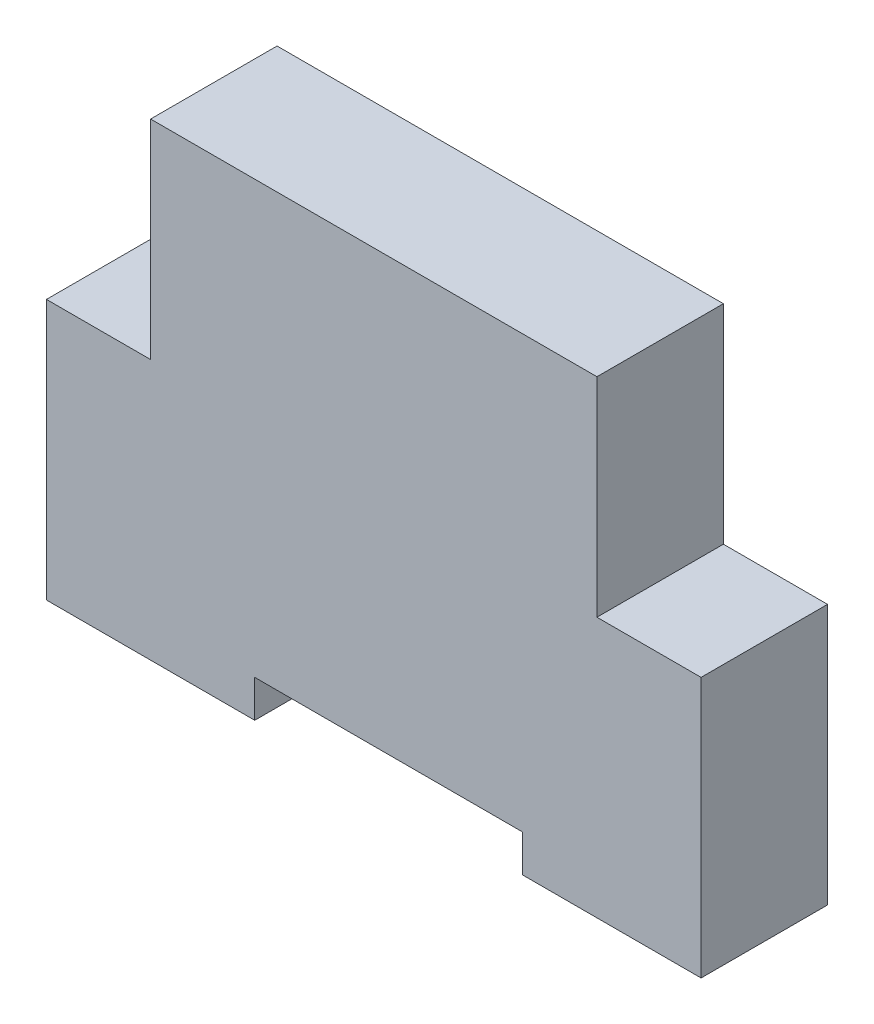
ISO-10303-21;
HEADER;
FILE_DESCRIPTION(('STEP AP214'),'2;1');
FILE_NAME('part.step','',(''),(''),'','','');
FILE_SCHEMA(('AUTOMOTIVE_DESIGN { 1 0 10303 214 1 1 1 1 }'));
ENDSEC;
DATA;
#1=APPLICATION_CONTEXT('core data for automotive mechanical design processes');
#2=APPLICATION_PROTOCOL_DEFINITION('international standard','automotive_design',2000,#1);
#3=PRODUCT_CONTEXT('',#1,'mechanical');
#4=PRODUCT('Part','Part','',(#3));
#5=PRODUCT_RELATED_PRODUCT_CATEGORY('part','',(#4));
#6=PRODUCT_DEFINITION_FORMATION('','',#4);
#7=PRODUCT_DEFINITION_CONTEXT('part definition',#1,'design');
#8=PRODUCT_DEFINITION('design','',#6,#7);
#9=PRODUCT_DEFINITION_SHAPE('','',#8);
#10=(LENGTH_UNIT() NAMED_UNIT(*) SI_UNIT(.MILLI.,.METRE.));
#11=(NAMED_UNIT(*) PLANE_ANGLE_UNIT() SI_UNIT($,.RADIAN.));
#12=(NAMED_UNIT(*) SI_UNIT($,.STERADIAN.) SOLID_ANGLE_UNIT());
#13=UNCERTAINTY_MEASURE_WITH_UNIT(LENGTH_MEASURE(1.E-05),#10,'distance_accuracy_value','');
#14=(GEOMETRIC_REPRESENTATION_CONTEXT(3) GLOBAL_UNCERTAINTY_ASSIGNED_CONTEXT((#13)) GLOBAL_UNIT_ASSIGNED_CONTEXT((#10,
#11,#12)) REPRESENTATION_CONTEXT('',''));
#15=CARTESIAN_POINT('',(0.,0.,0.));
#16=DIRECTION('',(0.,0.,1.));
#17=DIRECTION('',(1.,0.,0.));
#18=AXIS2_PLACEMENT_3D('',#15,#16,#17);
#19=CARTESIAN_POINT('',(-32.,30.,17.));
#20=DIRECTION('',(1.,0.,0.));
#21=DIRECTION('',(0.,0.,-1.));
#22=AXIS2_PLACEMENT_3D('',#19,#20,#21);
#23=PLANE('',#22);
#24=DIRECTION('',(0.,-1.,0.));
#25=VECTOR('',#24,1.);
#26=CARTESIAN_POINT('',(-32.,30.,0.));
#27=LINE('',#26,#25);
#28=CARTESIAN_POINT('',(-32.,58.,0.));
#29=VERTEX_POINT('',#28);
#30=CARTESIAN_POINT('',(-32.,30.,0.));
#31=VERTEX_POINT('',#30);
#32=EDGE_CURVE('E164',#29,#31,#27,.T.);
#33=ORIENTED_EDGE('',*,*,#32,.T.);
#34=DIRECTION('',(0.,0.,-1.));
#35=VECTOR('',#34,1.);
#36=CARTESIAN_POINT('',(-32.,30.,17.));
#37=LINE('',#36,#35);
#38=CARTESIAN_POINT('',(-32.,30.,17.));
#39=VERTEX_POINT('',#38);
#40=EDGE_CURVE('E11',#39,#31,#37,.T.);
#41=ORIENTED_EDGE('',*,*,#40,.F.);
#42=DIRECTION('',(0.,-1.,0.));
#43=VECTOR('',#42,1.);
#44=CARTESIAN_POINT('',(-32.,30.,17.));
#45=LINE('',#44,#43);
#46=CARTESIAN_POINT('',(-32.,58.,17.));
#47=VERTEX_POINT('',#46);
#48=EDGE_CURVE('E198',#47,#39,#45,.T.);
#49=ORIENTED_EDGE('',*,*,#48,.F.);
#50=DIRECTION('',(0.,0.,-1.));
#51=VECTOR('',#50,1.);
#52=CARTESIAN_POINT('',(-32.,58.,17.));
#53=LINE('',#52,#51);
#54=EDGE_CURVE('E160',#47,#29,#53,.T.);
#55=ORIENTED_EDGE('',*,*,#54,.T.);
#56=EDGE_LOOP('',(#33,#41,#49,#55));
#57=FACE_BOUND('',#56,.T.);
#58=ADVANCED_FACE('F39',(#57),#23,.F.);
#59=CARTESIAN_POINT('',(-46.,30.,17.));
#60=DIRECTION('',(0.,-1.,0.));
#61=DIRECTION('',(0.,0.,-1.));
#62=AXIS2_PLACEMENT_3D('',#59,#60,#61);
#63=PLANE('',#62);
#64=DIRECTION('',(-1.,0.,0.));
#65=VECTOR('',#64,1.);
#66=CARTESIAN_POINT('',(-46.,30.,0.));
#67=LINE('',#66,#65);
#68=CARTESIAN_POINT('',(-46.,30.,0.));
#69=VERTEX_POINT('',#68);
#70=EDGE_CURVE('E168',#31,#69,#67,.T.);
#71=ORIENTED_EDGE('',*,*,#70,.T.);
#72=DIRECTION('',(0.,0.,-1.));
#73=VECTOR('',#72,1.);
#74=CARTESIAN_POINT('',(-46.,30.,17.));
#75=LINE('',#74,#73);
#76=CARTESIAN_POINT('',(-46.,30.,17.));
#77=VERTEX_POINT('',#76);
#78=EDGE_CURVE('E48',#77,#69,#75,.T.);
#79=ORIENTED_EDGE('',*,*,#78,.F.);
#80=DIRECTION('',(-1.,0.,0.));
#81=VECTOR('',#80,1.);
#82=CARTESIAN_POINT('',(-46.,30.,17.));
#83=LINE('',#82,#81);
#84=EDGE_CURVE('E111',#39,#77,#83,.T.);
#85=ORIENTED_EDGE('',*,*,#84,.F.);
#86=ORIENTED_EDGE('',*,*,#40,.T.);
#87=EDGE_LOOP('',(#71,#79,#85,#86));
#88=FACE_BOUND('',#87,.T.);
#89=ADVANCED_FACE('F292',(#88),#63,.F.);
#90=CARTESIAN_POINT('',(-46.,-5.00000000000001,17.));
#91=DIRECTION('',(1.,0.,0.));
#92=DIRECTION('',(0.,1.,0.));
#93=AXIS2_PLACEMENT_3D('',#90,#91,#92);
#94=PLANE('',#93);
#95=DIRECTION('',(0.,-1.,0.));
#96=VECTOR('',#95,1.);
#97=CARTESIAN_POINT('',(-46.,-5.00000000000001,0.));
#98=LINE('',#97,#96);
#99=CARTESIAN_POINT('',(-46.,-5.00000000000001,0.));
#100=VERTEX_POINT('',#99);
#101=EDGE_CURVE('E171',#69,#100,#98,.T.);
#102=ORIENTED_EDGE('',*,*,#101,.T.);
#103=DIRECTION('',(0.,0.,-1.));
#104=VECTOR('',#103,1.);
#105=CARTESIAN_POINT('',(-46.,-5.00000000000001,17.));
#106=LINE('',#105,#104);
#107=CARTESIAN_POINT('',(-46.,-5.00000000000001,17.));
#108=VERTEX_POINT('',#107);
#109=EDGE_CURVE('E225',#108,#100,#106,.T.);
#110=ORIENTED_EDGE('',*,*,#109,.F.);
#111=DIRECTION('',(0.,-1.,0.));
#112=VECTOR('',#111,1.);
#113=CARTESIAN_POINT('',(-46.,-5.00000000000001,17.));
#114=LINE('',#113,#112);
#115=EDGE_CURVE('E235',#77,#108,#114,.T.);
#116=ORIENTED_EDGE('',*,*,#115,.F.);
#117=ORIENTED_EDGE('',*,*,#78,.T.);
#118=EDGE_LOOP('',(#102,#110,#116,#117));
#119=FACE_BOUND('',#118,.T.);
#120=ADVANCED_FACE('F233',(#119),#94,.F.);
#121=CARTESIAN_POINT('',(-18.,-5.,17.));
#122=DIRECTION('',(0.,1.,0.));
#123=DIRECTION('',(-1.,0.,0.));
#124=AXIS2_PLACEMENT_3D('',#121,#122,#123);
#125=PLANE('',#124);
#126=DIRECTION('',(1.,0.,0.));
#127=VECTOR('',#126,1.);
#128=CARTESIAN_POINT('',(-18.,-5.,0.));
#129=LINE('',#128,#127);
#130=CARTESIAN_POINT('',(-18.,-5.,0.));
#131=VERTEX_POINT('',#130);
#132=EDGE_CURVE('E174',#100,#131,#129,.T.);
#133=ORIENTED_EDGE('',*,*,#132,.T.);
#134=DIRECTION('',(0.,0.,-1.));
#135=VECTOR('',#134,1.);
#136=CARTESIAN_POINT('',(-18.,-5.,17.));
#137=LINE('',#136,#135);
#138=CARTESIAN_POINT('',(-18.,-5.,17.));
#139=VERTEX_POINT('',#138);
#140=EDGE_CURVE('E221',#139,#131,#137,.T.);
#141=ORIENTED_EDGE('',*,*,#140,.F.);
#142=DIRECTION('',(1.,0.,0.));
#143=VECTOR('',#142,1.);
#144=CARTESIAN_POINT('',(-18.,-5.,17.));
#145=LINE('',#144,#143);
#146=EDGE_CURVE('E254',#108,#139,#145,.T.);
#147=ORIENTED_EDGE('',*,*,#146,.F.);
#148=ORIENTED_EDGE('',*,*,#109,.T.);
#149=EDGE_LOOP('',(#133,#141,#147,#148));
#150=FACE_BOUND('',#149,.T.);
#151=ADVANCED_FACE('F244',(#150),#125,.F.);
#152=CARTESIAN_POINT('',(-18.,0.,17.));
#153=DIRECTION('',(-1.,0.,0.));
#154=DIRECTION('',(0.,-1.,0.));
#155=AXIS2_PLACEMENT_3D('',#152,#153,#154);
#156=PLANE('',#155);
#157=DIRECTION('',(0.,1.,0.));
#158=VECTOR('',#157,1.);
#159=CARTESIAN_POINT('',(-18.,0.,0.));
#160=LINE('',#159,#158);
#161=CARTESIAN_POINT('',(-18.,0.,0.));
#162=VERTEX_POINT('',#161);
#163=EDGE_CURVE('E177',#131,#162,#160,.T.);
#164=ORIENTED_EDGE('',*,*,#163,.T.);
#165=DIRECTION('',(0.,0.,-1.));
#166=VECTOR('',#165,1.);
#167=CARTESIAN_POINT('',(-18.,0.,17.));
#168=LINE('',#167,#166);
#169=CARTESIAN_POINT('',(-18.,0.,17.));
#170=VERTEX_POINT('',#169);
#171=EDGE_CURVE('E217',#170,#162,#168,.T.);
#172=ORIENTED_EDGE('',*,*,#171,.F.);
#173=DIRECTION('',(0.,1.,0.));
#174=VECTOR('',#173,1.);
#175=CARTESIAN_POINT('',(-18.,0.,17.));
#176=LINE('',#175,#174);
#177=EDGE_CURVE('E250',#139,#170,#176,.T.);
#178=ORIENTED_EDGE('',*,*,#177,.F.);
#179=ORIENTED_EDGE('',*,*,#140,.T.);
#180=EDGE_LOOP('',(#164,#172,#178,#179));
#181=FACE_BOUND('',#180,.T.);
#182=ADVANCED_FACE('F248',(#181),#156,.F.);
#183=CARTESIAN_POINT('',(18.,0.,17.));
#184=DIRECTION('',(0.,1.,0.));
#185=DIRECTION('',(-1.,0.,0.));
#186=AXIS2_PLACEMENT_3D('',#183,#184,#185);
#187=PLANE('',#186);
#188=DIRECTION('',(1.,0.,0.));
#189=VECTOR('',#188,1.);
#190=CARTESIAN_POINT('',(18.,0.,0.));
#191=LINE('',#190,#189);
#192=CARTESIAN_POINT('',(18.,0.,0.));
#193=VERTEX_POINT('',#192);
#194=EDGE_CURVE('E180',#162,#193,#191,.T.);
#195=ORIENTED_EDGE('',*,*,#194,.T.);
#196=DIRECTION('',(0.,0.,-1.));
#197=VECTOR('',#196,1.);
#198=CARTESIAN_POINT('',(18.,0.,17.));
#199=LINE('',#198,#197);
#200=CARTESIAN_POINT('',(18.,0.,17.));
#201=VERTEX_POINT('',#200);
#202=EDGE_CURVE('E213',#201,#193,#199,.T.);
#203=ORIENTED_EDGE('',*,*,#202,.F.);
#204=DIRECTION('',(1.,0.,0.));
#205=VECTOR('',#204,1.);
#206=CARTESIAN_POINT('',(18.,0.,17.));
#207=LINE('',#206,#205);
#208=EDGE_CURVE('E253',#170,#201,#207,.T.);
#209=ORIENTED_EDGE('',*,*,#208,.F.);
#210=ORIENTED_EDGE('',*,*,#171,.T.);
#211=EDGE_LOOP('',(#195,#203,#209,#210));
#212=FACE_BOUND('',#211,.T.);
#213=ADVANCED_FACE('F305',(#212),#187,.F.);
#214=CARTESIAN_POINT('',(18.,-4.99999999999999,17.));
#215=DIRECTION('',(1.,0.,0.));
#216=DIRECTION('',(0.,1.,0.));
#217=AXIS2_PLACEMENT_3D('',#214,#215,#216);
#218=PLANE('',#217);
#219=DIRECTION('',(0.,-1.,0.));
#220=VECTOR('',#219,1.);
#221=CARTESIAN_POINT('',(18.,-4.99999999999999,0.));
#222=LINE('',#221,#220);
#223=CARTESIAN_POINT('',(18.,-4.99999999999999,0.));
#224=VERTEX_POINT('',#223);
#225=EDGE_CURVE('E183',#193,#224,#222,.T.);
#226=ORIENTED_EDGE('',*,*,#225,.T.);
#227=DIRECTION('',(0.,0.,-1.));
#228=VECTOR('',#227,1.);
#229=CARTESIAN_POINT('',(18.,-4.99999999999999,17.));
#230=LINE('',#229,#228);
#231=CARTESIAN_POINT('',(18.,-4.99999999999999,17.));
#232=VERTEX_POINT('',#231);
#233=EDGE_CURVE('E209',#232,#224,#230,.T.);
#234=ORIENTED_EDGE('',*,*,#233,.F.);
#235=DIRECTION('',(0.,-1.,0.));
#236=VECTOR('',#235,1.);
#237=CARTESIAN_POINT('',(18.,-4.99999999999999,17.));
#238=LINE('',#237,#236);
#239=EDGE_CURVE('E258',#201,#232,#238,.T.);
#240=ORIENTED_EDGE('',*,*,#239,.F.);
#241=ORIENTED_EDGE('',*,*,#202,.T.);
#242=EDGE_LOOP('',(#226,#234,#240,#241));
#243=FACE_BOUND('',#242,.T.);
#244=ADVANCED_FACE('F308',(#243),#218,.F.);
#245=CARTESIAN_POINT('',(42.,-5.,17.));
#246=DIRECTION('',(0.,1.,0.));
#247=DIRECTION('',(-1.,0.,0.));
#248=AXIS2_PLACEMENT_3D('',#245,#246,#247);
#249=PLANE('',#248);
#250=DIRECTION('',(1.,0.,0.));
#251=VECTOR('',#250,1.);
#252=CARTESIAN_POINT('',(42.,-5.,0.));
#253=LINE('',#252,#251);
#254=CARTESIAN_POINT('',(42.,-5.,0.));
#255=VERTEX_POINT('',#254);
#256=EDGE_CURVE('E186',#224,#255,#253,.T.);
#257=ORIENTED_EDGE('',*,*,#256,.T.);
#258=DIRECTION('',(0.,0.,-1.));
#259=VECTOR('',#258,1.);
#260=CARTESIAN_POINT('',(42.,-5.,17.));
#261=LINE('',#260,#259);
#262=CARTESIAN_POINT('',(42.,-5.,17.));
#263=VERTEX_POINT('',#262);
#264=EDGE_CURVE('E205',#263,#255,#261,.T.);
#265=ORIENTED_EDGE('',*,*,#264,.F.);
#266=DIRECTION('',(1.,0.,0.));
#267=VECTOR('',#266,1.);
#268=CARTESIAN_POINT('',(42.,-5.,17.));
#269=LINE('',#268,#267);
#270=EDGE_CURVE('E265',#232,#263,#269,.T.);
#271=ORIENTED_EDGE('',*,*,#270,.F.);
#272=ORIENTED_EDGE('',*,*,#233,.T.);
#273=EDGE_LOOP('',(#257,#265,#271,#272));
#274=FACE_BOUND('',#273,.T.);
#275=ADVANCED_FACE('F273',(#274),#249,.F.);
#276=CARTESIAN_POINT('',(42.,30.,17.));
#277=DIRECTION('',(-1.,0.,0.));
#278=DIRECTION('',(0.,-1.,0.));
#279=AXIS2_PLACEMENT_3D('',#276,#277,#278);
#280=PLANE('',#279);
#281=DIRECTION('',(0.,1.,0.));
#282=VECTOR('',#281,1.);
#283=CARTESIAN_POINT('',(42.,30.,0.));
#284=LINE('',#283,#282);
#285=CARTESIAN_POINT('',(42.,30.,0.));
#286=VERTEX_POINT('',#285);
#287=EDGE_CURVE('E189',#255,#286,#284,.T.);
#288=ORIENTED_EDGE('',*,*,#287,.T.);
#289=DIRECTION('',(0.,0.,-1.));
#290=VECTOR('',#289,1.);
#291=CARTESIAN_POINT('',(42.,30.,17.));
#292=LINE('',#291,#290);
#293=CARTESIAN_POINT('',(42.,30.,17.));
#294=VERTEX_POINT('',#293);
#295=EDGE_CURVE('E153',#294,#286,#292,.T.);
#296=ORIENTED_EDGE('',*,*,#295,.F.);
#297=DIRECTION('',(0.,1.,0.));
#298=VECTOR('',#297,1.);
#299=CARTESIAN_POINT('',(42.,30.,17.));
#300=LINE('',#299,#298);
#301=EDGE_CURVE('E142',#263,#294,#300,.T.);
#302=ORIENTED_EDGE('',*,*,#301,.F.);
#303=ORIENTED_EDGE('',*,*,#264,.T.);
#304=EDGE_LOOP('',(#288,#296,#302,#303));
#305=FACE_BOUND('',#304,.T.);
#306=ADVANCED_FACE('F277',(#305),#280,.F.);
#307=CARTESIAN_POINT('',(28.,30.,17.));
#308=DIRECTION('',(0.,-1.,0.));
#309=DIRECTION('',(0.,0.,-1.));
#310=AXIS2_PLACEMENT_3D('',#307,#308,#309);
#311=PLANE('',#310);
#312=DIRECTION('',(-1.,0.,0.));
#313=VECTOR('',#312,1.);
#314=CARTESIAN_POINT('',(28.,30.,0.));
#315=LINE('',#314,#313);
#316=CARTESIAN_POINT('',(28.,30.,0.));
#317=VERTEX_POINT('',#316);
#318=EDGE_CURVE('E151',#286,#317,#315,.T.);
#319=ORIENTED_EDGE('',*,*,#318,.T.);
#320=DIRECTION('',(0.,0.,-1.));
#321=VECTOR('',#320,1.);
#322=CARTESIAN_POINT('',(28.,30.,17.));
#323=LINE('',#322,#321);
#324=CARTESIAN_POINT('',(28.,30.,17.));
#325=VERTEX_POINT('',#324);
#326=EDGE_CURVE('E148',#325,#317,#323,.T.);
#327=ORIENTED_EDGE('',*,*,#326,.F.);
#328=DIRECTION('',(-1.,0.,0.));
#329=VECTOR('',#328,1.);
#330=CARTESIAN_POINT('',(28.,30.,17.));
#331=LINE('',#330,#329);
#332=EDGE_CURVE('E136',#294,#325,#331,.T.);
#333=ORIENTED_EDGE('',*,*,#332,.F.);
#334=ORIENTED_EDGE('',*,*,#295,.T.);
#335=EDGE_LOOP('',(#319,#327,#333,#334));
#336=FACE_BOUND('',#335,.T.);
#337=ADVANCED_FACE('F149',(#336),#311,.F.);
#338=CARTESIAN_POINT('',(28.,58.,17.));
#339=DIRECTION('',(-1.,0.,0.));
#340=DIRECTION('',(0.,-1.,0.));
#341=AXIS2_PLACEMENT_3D('',#338,#339,#340);
#342=PLANE('',#341);
#343=DIRECTION('',(0.,1.,0.));
#344=VECTOR('',#343,1.);
#345=CARTESIAN_POINT('',(28.,58.,0.));
#346=LINE('',#345,#344);
#347=CARTESIAN_POINT('',(28.,58.,0.));
#348=VERTEX_POINT('',#347);
#349=EDGE_CURVE('E97',#317,#348,#346,.T.);
#350=ORIENTED_EDGE('',*,*,#349,.T.);
#351=DIRECTION('',(0.,0.,-1.));
#352=VECTOR('',#351,1.);
#353=CARTESIAN_POINT('',(28.,58.,17.));
#354=LINE('',#353,#352);
#355=CARTESIAN_POINT('',(28.,58.,17.));
#356=VERTEX_POINT('',#355);
#357=EDGE_CURVE('E154',#356,#348,#354,.T.);
#358=ORIENTED_EDGE('',*,*,#357,.F.);
#359=DIRECTION('',(0.,1.,0.));
#360=VECTOR('',#359,1.);
#361=CARTESIAN_POINT('',(28.,58.,17.));
#362=LINE('',#361,#360);
#363=EDGE_CURVE('E140',#325,#356,#362,.T.);
#364=ORIENTED_EDGE('',*,*,#363,.F.);
#365=ORIENTED_EDGE('',*,*,#326,.T.);
#366=EDGE_LOOP('',(#350,#358,#364,#365));
#367=FACE_BOUND('',#366,.T.);
#368=ADVANCED_FACE('F156',(#367),#342,.F.);
#369=CARTESIAN_POINT('',(-32.,58.,17.));
#370=DIRECTION('',(0.,-1.,0.));
#371=DIRECTION('',(0.,0.,-1.));
#372=AXIS2_PLACEMENT_3D('',#369,#370,#371);
#373=PLANE('',#372);
#374=DIRECTION('',(-1.,0.,0.));
#375=VECTOR('',#374,1.);
#376=CARTESIAN_POINT('',(-32.,58.,0.));
#377=LINE('',#376,#375);
#378=EDGE_CURVE('E103',#348,#29,#377,.T.);
#379=ORIENTED_EDGE('',*,*,#378,.T.);
#380=ORIENTED_EDGE('',*,*,#54,.F.);
#381=DIRECTION('',(-1.,0.,0.));
#382=VECTOR('',#381,1.);
#383=CARTESIAN_POINT('',(-32.,58.,17.));
#384=LINE('',#383,#382);
#385=EDGE_CURVE('E56',#356,#47,#384,.T.);
#386=ORIENTED_EDGE('',*,*,#385,.F.);
#387=ORIENTED_EDGE('',*,*,#357,.T.);
#388=EDGE_LOOP('',(#379,#380,#386,#387));
#389=FACE_BOUND('',#388,.T.);
#390=ADVANCED_FACE('F281',(#389),#373,.F.);
#391=CARTESIAN_POINT('',(0.,0.,17.));
#392=DIRECTION('',(0.,0.,-1.));
#393=DIRECTION('',(-1.,0.,0.));
#394=AXIS2_PLACEMENT_3D('',#391,#392,#393);
#395=PLANE('',#394);
#396=ORIENTED_EDGE('',*,*,#48,.T.);
#397=ORIENTED_EDGE('',*,*,#84,.T.);
#398=ORIENTED_EDGE('',*,*,#115,.T.);
#399=ORIENTED_EDGE('',*,*,#146,.T.);
#400=ORIENTED_EDGE('',*,*,#177,.T.);
#401=ORIENTED_EDGE('',*,*,#208,.T.);
#402=ORIENTED_EDGE('',*,*,#239,.T.);
#403=ORIENTED_EDGE('',*,*,#270,.T.);
#404=ORIENTED_EDGE('',*,*,#301,.T.);
#405=ORIENTED_EDGE('',*,*,#332,.T.);
#406=ORIENTED_EDGE('',*,*,#363,.T.);
#407=ORIENTED_EDGE('',*,*,#385,.T.);
#408=EDGE_LOOP('',(#396,#397,#398,#399,#400,#401,#402,#403,#404,#405,#406,#407));
#409=FACE_BOUND('',#408,.T.);
#410=ADVANCED_FACE('F138',(#409),#395,.F.);
#411=CARTESIAN_POINT('',(0.,0.,0.));
#412=DIRECTION('',(0.,0.,-1.));
#413=DIRECTION('',(-1.,0.,0.));
#414=AXIS2_PLACEMENT_3D('',#411,#412,#413);
#415=PLANE('',#414);
#416=ORIENTED_EDGE('',*,*,#32,.F.);
#417=ORIENTED_EDGE('',*,*,#378,.F.);
#418=ORIENTED_EDGE('',*,*,#349,.F.);
#419=ORIENTED_EDGE('',*,*,#318,.F.);
#420=ORIENTED_EDGE('',*,*,#287,.F.);
#421=ORIENTED_EDGE('',*,*,#256,.F.);
#422=ORIENTED_EDGE('',*,*,#225,.F.);
#423=ORIENTED_EDGE('',*,*,#194,.F.);
#424=ORIENTED_EDGE('',*,*,#163,.F.);
#425=ORIENTED_EDGE('',*,*,#132,.F.);
#426=ORIENTED_EDGE('',*,*,#101,.F.);
#427=ORIENTED_EDGE('',*,*,#70,.F.);
#428=EDGE_LOOP('',(#416,#417,#418,#419,#420,#421,#422,#423,#424,#425,#426,#427));
#429=FACE_BOUND('',#428,.T.);
#430=ADVANCED_FACE('F239',(#429),#415,.T.);
#431=CLOSED_SHELL('',(#58,#89,#120,#151,#182,#213,#244,#275,#306,#337,#368,#390,#410,#430));
#432=MANIFOLD_SOLID_BREP('B2',#431);
#433=ADVANCED_BREP_SHAPE_REPRESENTATION('',(#18,#432),#14);
#434=SHAPE_DEFINITION_REPRESENTATION(#9,#433);
ENDSEC;
END-ISO-10303-21;
